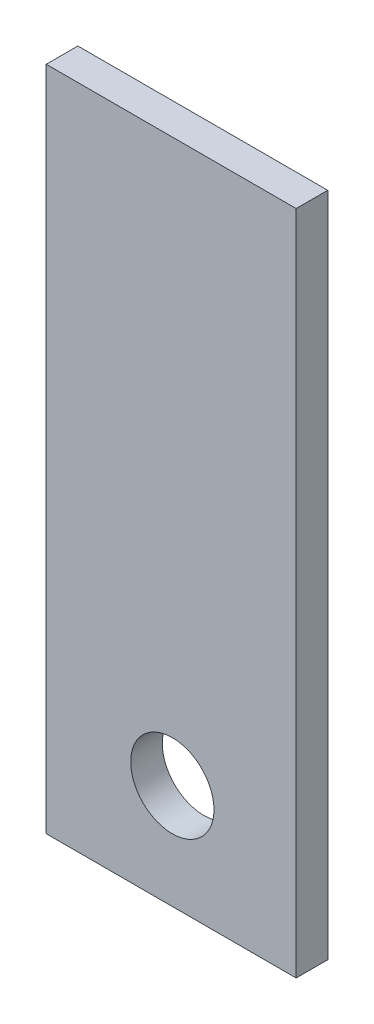
ISO-10303-21;
HEADER;
FILE_DESCRIPTION(('STEP AP214'),'2;1');
FILE_NAME('part.step','',(''),(''),'','','');
FILE_SCHEMA(('AUTOMOTIVE_DESIGN { 1 0 10303 214 1 1 1 1 }'));
ENDSEC;
DATA;
#1=APPLICATION_CONTEXT('core data for automotive mechanical design processes');
#2=APPLICATION_PROTOCOL_DEFINITION('international standard','automotive_design',2000,#1);
#3=PRODUCT_CONTEXT('',#1,'mechanical');
#4=PRODUCT('Part','Part','',(#3));
#5=PRODUCT_RELATED_PRODUCT_CATEGORY('part','',(#4));
#6=PRODUCT_DEFINITION_FORMATION('','',#4);
#7=PRODUCT_DEFINITION_CONTEXT('part definition',#1,'design');
#8=PRODUCT_DEFINITION('design','',#6,#7);
#9=PRODUCT_DEFINITION_SHAPE('','',#8);
#10=(LENGTH_UNIT() NAMED_UNIT(*) SI_UNIT(.MILLI.,.METRE.));
#11=(NAMED_UNIT(*) PLANE_ANGLE_UNIT() SI_UNIT($,.RADIAN.));
#12=(NAMED_UNIT(*) SI_UNIT($,.STERADIAN.) SOLID_ANGLE_UNIT());
#13=UNCERTAINTY_MEASURE_WITH_UNIT(LENGTH_MEASURE(1.E-05),#10,'distance_accuracy_value','');
#14=(GEOMETRIC_REPRESENTATION_CONTEXT(3) GLOBAL_UNCERTAINTY_ASSIGNED_CONTEXT((#13)) GLOBAL_UNIT_ASSIGNED_CONTEXT((#10,
#11,#12)) REPRESENTATION_CONTEXT('',''));
#15=CARTESIAN_POINT('',(0.,0.,0.));
#16=DIRECTION('',(0.,0.,1.));
#17=DIRECTION('',(1.,0.,0.));
#18=AXIS2_PLACEMENT_3D('',#15,#16,#17);
#19=CARTESIAN_POINT('',(-19.0822124305765,-4.34766766412355,-1.89738));
#20=DIRECTION('',(-1.,0.,0.));
#21=DIRECTION('',(0.,0.,1.));
#22=AXIS2_PLACEMENT_3D('',#19,#20,#21);
#23=PLANE('',#22);
#24=DIRECTION('',(0.,-1.,0.));
#25=VECTOR('',#24,1.);
#26=CARTESIAN_POINT('',(-19.0822124305765,-4.34766766412355,0.));
#27=LINE('',#26,#25);
#28=CARTESIAN_POINT('',(-19.0822124305765,35.6523323358764,0.));
#29=VERTEX_POINT('',#28);
#30=CARTESIAN_POINT('',(-19.0822124305765,-4.34766766412355,0.));
#31=VERTEX_POINT('',#30);
#32=EDGE_CURVE('E100',#29,#31,#27,.T.);
#33=ORIENTED_EDGE('',*,*,#32,.F.);
#34=DIRECTION('',(0.,0.,1.));
#35=VECTOR('',#34,1.);
#36=CARTESIAN_POINT('',(-19.0822124305765,35.6523323358764,-1.89738));
#37=LINE('',#36,#35);
#38=CARTESIAN_POINT('',(-19.0822124305765,35.6523323358764,-1.89738));
#39=VERTEX_POINT('',#38);
#40=EDGE_CURVE('E11',#39,#29,#37,.T.);
#41=ORIENTED_EDGE('',*,*,#40,.F.);
#42=DIRECTION('',(0.,-1.,0.));
#43=VECTOR('',#42,1.);
#44=CARTESIAN_POINT('',(-19.0822124305765,-4.34766766412355,-1.89738));
#45=LINE('',#44,#43);
#46=CARTESIAN_POINT('',(-19.0822124305765,-4.34766766412355,-1.89738));
#47=VERTEX_POINT('',#46);
#48=EDGE_CURVE('E93',#39,#47,#45,.T.);
#49=ORIENTED_EDGE('',*,*,#48,.T.);
#50=DIRECTION('',(0.,0.,1.));
#51=VECTOR('',#50,1.);
#52=CARTESIAN_POINT('',(-19.0822124305765,-4.34766766412355,-1.89738));
#53=LINE('',#52,#51);
#54=EDGE_CURVE('E38',#47,#31,#53,.T.);
#55=ORIENTED_EDGE('',*,*,#54,.T.);
#56=EDGE_LOOP('',(#33,#41,#49,#55));
#57=FACE_BOUND('',#56,.T.);
#58=ADVANCED_FACE('F35',(#57),#23,.T.);
#59=CARTESIAN_POINT('',(-19.0822124305765,35.6523323358764,-1.89738));
#60=DIRECTION('',(0.,1.,0.));
#61=DIRECTION('',(0.,0.,1.));
#62=AXIS2_PLACEMENT_3D('',#59,#60,#61);
#63=PLANE('',#62);
#64=DIRECTION('',(-1.,0.,0.));
#65=VECTOR('',#64,1.);
#66=CARTESIAN_POINT('',(-19.0822124305765,35.6523323358764,0.));
#67=LINE('',#66,#65);
#68=CARTESIAN_POINT('',(-4.08221243057651,35.6523323358764,0.));
#69=VERTEX_POINT('',#68);
#70=EDGE_CURVE('E95',#69,#29,#67,.T.);
#71=ORIENTED_EDGE('',*,*,#70,.F.);
#72=DIRECTION('',(0.,0.,1.));
#73=VECTOR('',#72,1.);
#74=CARTESIAN_POINT('',(-4.08221243057651,35.6523323358764,-1.89738));
#75=LINE('',#74,#73);
#76=CARTESIAN_POINT('',(-4.08221243057651,35.6523323358764,-1.89738));
#77=VERTEX_POINT('',#76);
#78=EDGE_CURVE('E44',#77,#69,#75,.T.);
#79=ORIENTED_EDGE('',*,*,#78,.F.);
#80=DIRECTION('',(-1.,0.,0.));
#81=VECTOR('',#80,1.);
#82=CARTESIAN_POINT('',(-19.0822124305765,35.6523323358764,-1.89738));
#83=LINE('',#82,#81);
#84=EDGE_CURVE('E90',#77,#39,#83,.T.);
#85=ORIENTED_EDGE('',*,*,#84,.T.);
#86=ORIENTED_EDGE('',*,*,#40,.T.);
#87=EDGE_LOOP('',(#71,#79,#85,#86));
#88=FACE_BOUND('',#87,.T.);
#89=ADVANCED_FACE('F111',(#88),#63,.T.);
#90=CARTESIAN_POINT('',(-4.08221243057651,-4.34766766412355,-1.89738));
#91=DIRECTION('',(1.,0.,0.));
#92=DIRECTION('',(0.,0.,-1.));
#93=AXIS2_PLACEMENT_3D('',#90,#91,#92);
#94=PLANE('',#93);
#95=DIRECTION('',(0.,1.,0.));
#96=VECTOR('',#95,1.);
#97=CARTESIAN_POINT('',(-4.08221243057651,-4.34766766412355,0.));
#98=LINE('',#97,#96);
#99=CARTESIAN_POINT('',(-4.08221243057651,-4.34766766412355,0.));
#100=VERTEX_POINT('',#99);
#101=EDGE_CURVE('E85',#100,#69,#98,.T.);
#102=ORIENTED_EDGE('',*,*,#101,.F.);
#103=DIRECTION('',(0.,0.,1.));
#104=VECTOR('',#103,1.);
#105=CARTESIAN_POINT('',(-4.08221243057651,-4.34766766412355,-1.89738));
#106=LINE('',#105,#104);
#107=CARTESIAN_POINT('',(-4.08221243057651,-4.34766766412355,-1.89738));
#108=VERTEX_POINT('',#107);
#109=EDGE_CURVE('E80',#108,#100,#106,.T.);
#110=ORIENTED_EDGE('',*,*,#109,.F.);
#111=DIRECTION('',(0.,1.,0.));
#112=VECTOR('',#111,1.);
#113=CARTESIAN_POINT('',(-4.08221243057651,-4.34766766412355,-1.89738));
#114=LINE('',#113,#112);
#115=EDGE_CURVE('E83',#108,#77,#114,.T.);
#116=ORIENTED_EDGE('',*,*,#115,.T.);
#117=ORIENTED_EDGE('',*,*,#78,.T.);
#118=EDGE_LOOP('',(#102,#110,#116,#117));
#119=FACE_BOUND('',#118,.T.);
#120=ADVANCED_FACE('F82',(#119),#94,.T.);
#121=CARTESIAN_POINT('',(-19.0822124305765,-4.34766766412355,-1.89738));
#122=DIRECTION('',(0.,-1.,0.));
#123=DIRECTION('',(0.,0.,-1.));
#124=AXIS2_PLACEMENT_3D('',#121,#122,#123);
#125=PLANE('',#124);
#126=DIRECTION('',(1.,0.,0.));
#127=VECTOR('',#126,1.);
#128=CARTESIAN_POINT('',(-19.0822124305765,-4.34766766412355,0.));
#129=LINE('',#128,#127);
#130=EDGE_CURVE('E103',#31,#100,#129,.T.);
#131=ORIENTED_EDGE('',*,*,#130,.F.);
#132=ORIENTED_EDGE('',*,*,#54,.F.);
#133=DIRECTION('',(1.,0.,0.));
#134=VECTOR('',#133,1.);
#135=CARTESIAN_POINT('',(-19.0822124305765,-4.34766766412355,-1.89738));
#136=LINE('',#135,#134);
#137=EDGE_CURVE('E89',#47,#108,#136,.T.);
#138=ORIENTED_EDGE('',*,*,#137,.T.);
#139=ORIENTED_EDGE('',*,*,#109,.T.);
#140=EDGE_LOOP('',(#131,#132,#138,#139));
#141=FACE_BOUND('',#140,.T.);
#142=ADVANCED_FACE('F92',(#141),#125,.T.);
#143=CARTESIAN_POINT('',(0.,0.,-1.89738));
#144=DIRECTION('',(0.,0.,-1.));
#145=DIRECTION('',(-1.,0.,0.));
#146=AXIS2_PLACEMENT_3D('',#143,#144,#145);
#147=PLANE('',#146);
#148=CARTESIAN_POINT('',(-11.5134120064573,1.93188698569918,-1.89738));
#149=DIRECTION('',(0.,0.,-1.));
#150=DIRECTION('',(-1.,0.,0.));
#151=AXIS2_PLACEMENT_3D('',#148,#149,#150);
#152=CIRCLE('',#151,2.5);
#153=CARTESIAN_POINT('',(-14.0134120064573,1.93188698569918,-1.89738));
#154=VERTEX_POINT('',#153);
#155=EDGE_CURVE('E104',#154,#154,#152,.T.);
#156=ORIENTED_EDGE('',*,*,#155,.F.);
#157=EDGE_LOOP('',(#156));
#158=FACE_BOUND('',#157,.T.);
#159=ORIENTED_EDGE('',*,*,#48,.F.);
#160=ORIENTED_EDGE('',*,*,#84,.F.);
#161=ORIENTED_EDGE('',*,*,#115,.F.);
#162=ORIENTED_EDGE('',*,*,#137,.F.);
#163=EDGE_LOOP('',(#159,#160,#161,#162));
#164=FACE_BOUND('',#163,.T.);
#165=ADVANCED_FACE('F88',(#158,#164),#147,.T.);
#166=CARTESIAN_POINT('',(0.,0.,0.));
#167=DIRECTION('',(0.,0.,-1.));
#168=DIRECTION('',(-1.,0.,0.));
#169=AXIS2_PLACEMENT_3D('',#166,#167,#168);
#170=PLANE('',#169);
#171=CARTESIAN_POINT('',(-11.5134120064573,1.93188698569918,0.));
#172=DIRECTION('',(0.,0.,1.));
#173=DIRECTION('',(1.,0.,0.));
#174=AXIS2_PLACEMENT_3D('',#171,#172,#173);
#175=CIRCLE('',#174,2.5);
#176=CARTESIAN_POINT('',(-9.01341200645734,1.93188698569918,0.));
#177=VERTEX_POINT('',#176);
#178=EDGE_CURVE('E141',#177,#177,#175,.T.);
#179=ORIENTED_EDGE('',*,*,#178,.F.);
#180=EDGE_LOOP('',(#179));
#181=FACE_BOUND('',#180,.T.);
#182=ORIENTED_EDGE('',*,*,#32,.T.);
#183=ORIENTED_EDGE('',*,*,#130,.T.);
#184=ORIENTED_EDGE('',*,*,#101,.T.);
#185=ORIENTED_EDGE('',*,*,#70,.T.);
#186=EDGE_LOOP('',(#182,#183,#184,#185));
#187=FACE_BOUND('',#186,.T.);
#188=ADVANCED_FACE('F110',(#181,#187),#170,.F.);
#189=CARTESIAN_POINT('',(-11.5134120064573,1.93188698569918,-2.));
#190=DIRECTION('',(0.,0.,1.));
#191=DIRECTION('',(1.,0.,0.));
#192=AXIS2_PLACEMENT_3D('',#189,#190,#191);
#193=CYLINDRICAL_SURFACE('',#192,2.5);
#194=ORIENTED_EDGE('',*,*,#155,.T.);
#195=EDGE_LOOP('',(#194));
#196=FACE_BOUND('',#195,.T.);
#197=ORIENTED_EDGE('',*,*,#178,.T.);
#198=EDGE_LOOP('',(#197));
#199=FACE_BOUND('',#198,.T.);
#200=ADVANCED_FACE('F129',(#196,#199),#193,.F.);
#201=CLOSED_SHELL('',(#58,#89,#120,#142,#165,#188,#200));
#202=MANIFOLD_SOLID_BREP('B2',#201);
#203=ADVANCED_BREP_SHAPE_REPRESENTATION('',(#18,#202),#14);
#204=SHAPE_DEFINITION_REPRESENTATION(#9,#203);
ENDSEC;
END-ISO-10303-21;
